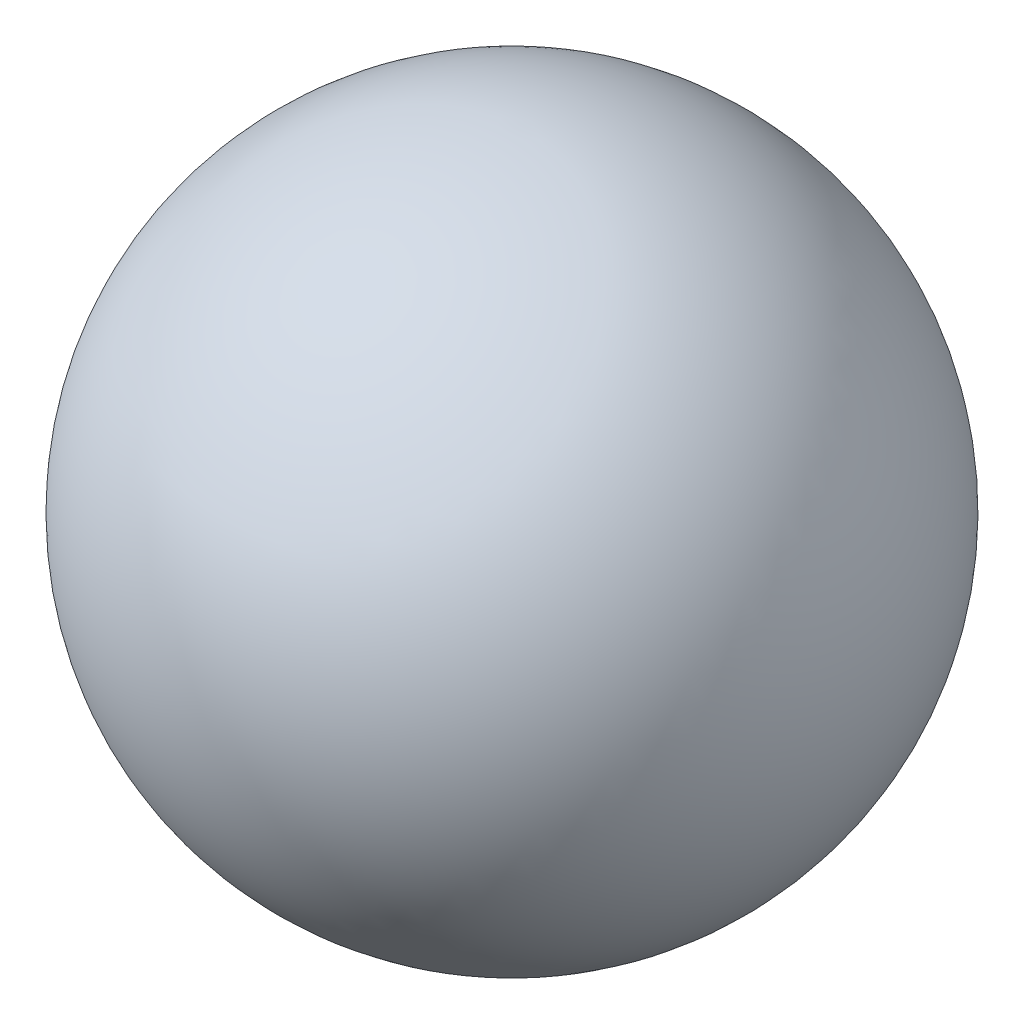
ISO-10303-21;
HEADER;
FILE_DESCRIPTION(('STEP AP214'),'2;1');
FILE_NAME('part.step','',(''),(''),'','','');
FILE_SCHEMA(('AUTOMOTIVE_DESIGN { 1 0 10303 214 1 1 1 1 }'));
ENDSEC;
DATA;
#1=APPLICATION_CONTEXT('core data for automotive mechanical design processes');
#2=APPLICATION_PROTOCOL_DEFINITION('international standard','automotive_design',2000,#1);
#3=PRODUCT_CONTEXT('',#1,'mechanical');
#4=PRODUCT('Part','Part','',(#3));
#5=PRODUCT_RELATED_PRODUCT_CATEGORY('part','',(#4));
#6=PRODUCT_DEFINITION_FORMATION('','',#4);
#7=PRODUCT_DEFINITION_CONTEXT('part definition',#1,'design');
#8=PRODUCT_DEFINITION('design','',#6,#7);
#9=PRODUCT_DEFINITION_SHAPE('','',#8);
#10=(LENGTH_UNIT() NAMED_UNIT(*) SI_UNIT(.MILLI.,.METRE.));
#11=(NAMED_UNIT(*) PLANE_ANGLE_UNIT() SI_UNIT($,.RADIAN.));
#12=(NAMED_UNIT(*) SI_UNIT($,.STERADIAN.) SOLID_ANGLE_UNIT());
#13=UNCERTAINTY_MEASURE_WITH_UNIT(LENGTH_MEASURE(1.E-05),#10,'distance_accuracy_value','');
#14=(GEOMETRIC_REPRESENTATION_CONTEXT(3) GLOBAL_UNCERTAINTY_ASSIGNED_CONTEXT((#13)) GLOBAL_UNIT_ASSIGNED_CONTEXT((#10,
#11,#12)) REPRESENTATION_CONTEXT('',''));
#15=CARTESIAN_POINT('',(0.,0.,0.));
#16=DIRECTION('',(0.,0.,1.));
#17=DIRECTION('',(1.,0.,0.));
#18=AXIS2_PLACEMENT_3D('',#15,#16,#17);
#19=CARTESIAN_POINT('',(67.76,-69.2244983991356,4.12850791910056));
#20=DIRECTION('',(0.,-0.998226300863558,0.0595336229727175));
#21=DIRECTION('',(0.173648177666934,-0.0586291734684379,-0.983061000351128));
#22=AXIS2_PLACEMENT_3D('',#19,#20,#21);
#23=SPHERICAL_SURFACE('',#22,7.15);
#24=CARTESIAN_POINT('',(67.76,-76.36181645031,4.55417332335549));
#25=VERTEX_POINT('',#24);
#26=VERTEX_LOOP('',#25);
#27=FACE_BOUND('',#26,.T.);
#28=CARTESIAN_POINT('',(67.76,-62.0871803479612,3.70284251484563));
#29=VERTEX_POINT('',#28);
#30=VERTEX_LOOP('',#29);
#31=FACE_BOUND('',#30,.T.);
#32=ADVANCED_FACE('F16',(#27,#31),#23,.T.);
#33=CLOSED_SHELL('',(#32));
#34=MANIFOLD_SOLID_BREP('B1',#33);
#35=ADVANCED_BREP_SHAPE_REPRESENTATION('',(#18,#34),#14);
#36=SHAPE_DEFINITION_REPRESENTATION(#9,#35);
ENDSEC;
END-ISO-10303-21;
